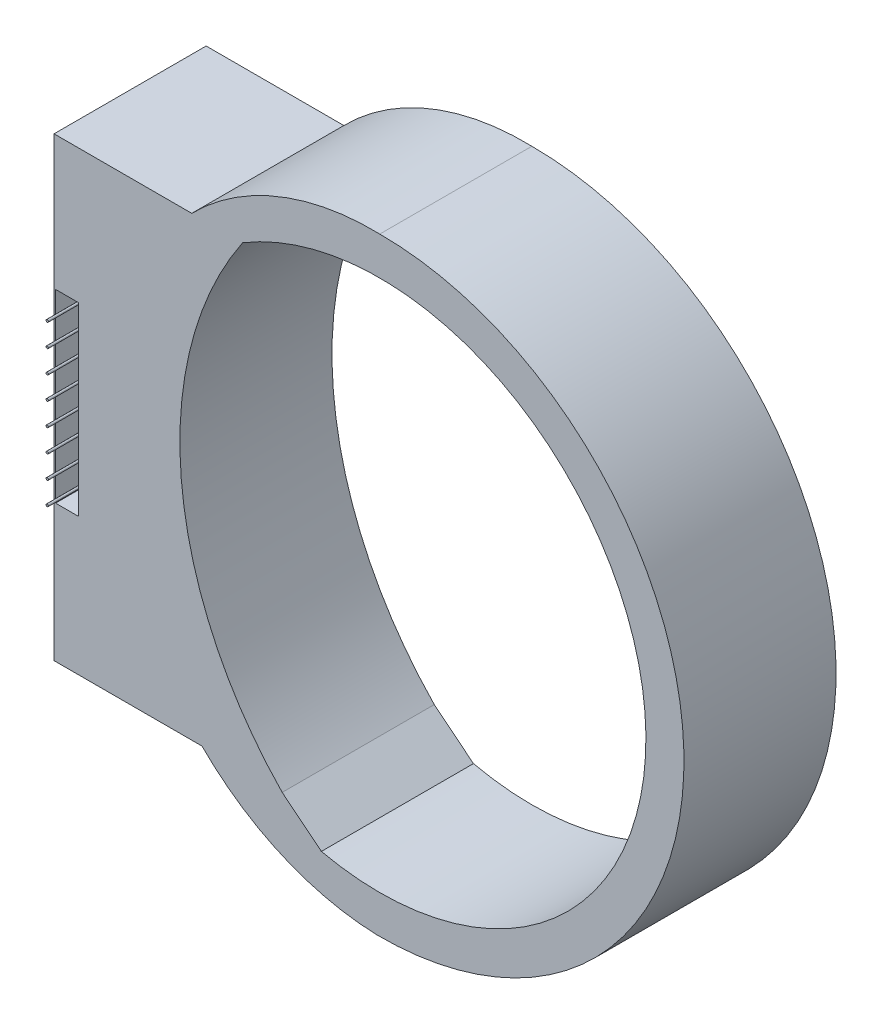
ISO-10303-21;
HEADER;
FILE_DESCRIPTION(('STEP AP214'),'2;1');
FILE_NAME('part.step','',(''),(''),'','','');
FILE_SCHEMA(('AUTOMOTIVE_DESIGN { 1 0 10303 214 1 1 1 1 }'));
ENDSEC;
DATA;
#1=APPLICATION_CONTEXT('core data for automotive mechanical design processes');
#2=APPLICATION_PROTOCOL_DEFINITION('international standard','automotive_design',2000,#1);
#3=PRODUCT_CONTEXT('',#1,'mechanical');
#4=PRODUCT('Part','Part','',(#3));
#5=PRODUCT_RELATED_PRODUCT_CATEGORY('part','',(#4));
#6=PRODUCT_DEFINITION_FORMATION('','',#4);
#7=PRODUCT_DEFINITION_CONTEXT('part definition',#1,'design');
#8=PRODUCT_DEFINITION('design','',#6,#7);
#9=PRODUCT_DEFINITION_SHAPE('','',#8);
#10=(LENGTH_UNIT() NAMED_UNIT(*) SI_UNIT(.MILLI.,.METRE.));
#11=(NAMED_UNIT(*) PLANE_ANGLE_UNIT() SI_UNIT($,.RADIAN.));
#12=(NAMED_UNIT(*) SI_UNIT($,.STERADIAN.) SOLID_ANGLE_UNIT());
#13=UNCERTAINTY_MEASURE_WITH_UNIT(LENGTH_MEASURE(1.E-05),#10,'distance_accuracy_value','');
#14=(GEOMETRIC_REPRESENTATION_CONTEXT(3) GLOBAL_UNCERTAINTY_ASSIGNED_CONTEXT((#13)) GLOBAL_UNIT_ASSIGNED_CONTEXT((#10,
#11,#12)) REPRESENTATION_CONTEXT('',''));
#15=CARTESIAN_POINT('',(0.,0.,0.));
#16=DIRECTION('',(0.,0.,1.));
#17=DIRECTION('',(1.,0.,0.));
#18=AXIS2_PLACEMENT_3D('',#15,#16,#17);
#19=CARTESIAN_POINT('',(-25.0193855044636,-31.0780217274881,25.4));
#20=DIRECTION('',(0.627091051685039,0.778945962757721,0.));
#21=DIRECTION('',(-0.778945962757721,0.627091051685039,0.));
#22=AXIS2_PLACEMENT_3D('',#19,#20,#21);
#23=PLANE('',#22);
#24=DIRECTION('',(0.778945962757721,-0.627091051685039,0.));
#25=VECTOR('',#24,1.);
#26=CARTESIAN_POINT('',(-25.0193855044636,-31.0780217274881,0.));
#27=LINE('',#26,#25);
#28=CARTESIAN_POINT('',(-16.2969812997664,-38.1,0.));
#29=VERTEX_POINT('',#28);
#30=CARTESIAN_POINT('',(-9.75543472759003,-43.3662771433718,0.));
#31=VERTEX_POINT('',#30);
#32=EDGE_CURVE('E142',#29,#31,#27,.T.);
#33=ORIENTED_EDGE('',*,*,#32,.F.);
#34=DIRECTION('',(0.,0.,-1.));
#35=VECTOR('',#34,1.);
#36=CARTESIAN_POINT('',(-16.2969812997664,-38.1,25.4));
#37=LINE('',#36,#35);
#38=CARTESIAN_POINT('',(-16.2969812997664,-38.1,25.4));
#39=VERTEX_POINT('',#38);
#40=EDGE_CURVE('E11',#39,#29,#37,.T.);
#41=ORIENTED_EDGE('',*,*,#40,.F.);
#42=DIRECTION('',(0.778945962757721,-0.627091051685039,0.));
#43=VECTOR('',#42,1.);
#44=CARTESIAN_POINT('',(-25.0193855044636,-31.0780217274881,25.4));
#45=LINE('',#44,#43);
#46=CARTESIAN_POINT('',(-9.75543472759003,-43.3662771433718,25.4));
#47=VERTEX_POINT('',#46);
#48=EDGE_CURVE('E140',#39,#47,#45,.T.);
#49=ORIENTED_EDGE('',*,*,#48,.T.);
#50=DIRECTION('',(0.,0.,-1.));
#51=VECTOR('',#50,1.);
#52=CARTESIAN_POINT('',(-9.75543472759003,-43.3662771433718,25.4));
#53=LINE('',#52,#51);
#54=EDGE_CURVE('E77',#47,#31,#53,.T.);
#55=ORIENTED_EDGE('',*,*,#54,.T.);
#56=EDGE_LOOP('',(#33,#41,#49,#55));
#57=FACE_BOUND('',#56,.T.);
#58=ADVANCED_FACE('F51',(#57),#23,.T.);
#59=CARTESIAN_POINT('',(27.1543478177107,4.04819094237765,25.4));
#60=DIRECTION('',(0.,0.,-1.));
#61=DIRECTION('',(-1.,0.,0.));
#62=AXIS2_PLACEMENT_3D('',#59,#60,#61);
#63=CYLINDRICAL_SURFACE('',#62,60.5350146757266);
#64=CARTESIAN_POINT('',(27.1543478177107,4.04819094237765,0.));
#65=DIRECTION('',(0.,0.,1.));
#66=DIRECTION('',(1.,0.,0.));
#67=AXIS2_PLACEMENT_3D('',#64,#65,#66);
#68=CIRCLE('',#67,60.5350146757266);
#69=CARTESIAN_POINT('',(-22.8952505991963,38.1,0.));
#70=VERTEX_POINT('',#69);
#71=EDGE_CURVE('E179',#29,#70,#68,.F.);
#72=ORIENTED_EDGE('',*,*,#71,.T.);
#73=DIRECTION('',(0.,0.,-1.));
#74=VECTOR('',#73,1.);
#75=CARTESIAN_POINT('',(-22.8952505991963,38.1,25.4));
#76=LINE('',#75,#74);
#77=CARTESIAN_POINT('',(-22.8952505991963,38.1,25.4));
#78=VERTEX_POINT('',#77);
#79=EDGE_CURVE('E60',#78,#70,#76,.T.);
#80=ORIENTED_EDGE('',*,*,#79,.F.);
#81=CARTESIAN_POINT('',(27.1543478177107,4.04819094237765,25.4));
#82=DIRECTION('',(0.,0.,1.));
#83=DIRECTION('',(1.,0.,0.));
#84=AXIS2_PLACEMENT_3D('',#81,#82,#83);
#85=CIRCLE('',#84,60.5350146757266);
#86=EDGE_CURVE('E147',#39,#78,#85,.F.);
#87=ORIENTED_EDGE('',*,*,#86,.F.);
#88=ORIENTED_EDGE('',*,*,#40,.T.);
#89=EDGE_LOOP('',(#72,#80,#87,#88));
#90=FACE_BOUND('',#89,.T.);
#91=ADVANCED_FACE('F148',(#90),#63,.F.);
#92=CARTESIAN_POINT('',(0.,0.,25.4));
#93=DIRECTION('',(0.,0.,-1.));
#94=DIRECTION('',(-1.,0.,0.));
#95=AXIS2_PLACEMENT_3D('',#92,#93,#94);
#96=CYLINDRICAL_SURFACE('',#95,50.8);
#97=CARTESIAN_POINT('',(0.,0.,0.));
#98=DIRECTION('',(0.,0.,1.));
#99=DIRECTION('',(1.,0.,0.));
#100=AXIS2_PLACEMENT_3D('',#97,#98,#99);
#101=CIRCLE('',#100,50.8);
#102=CARTESIAN_POINT('',(-0.524948031046554,-50.7972876201545,0.));
#103=VERTEX_POINT('',#102);
#104=CARTESIAN_POINT('',(0.,50.8,0.));
#105=VERTEX_POINT('',#104);
#106=EDGE_CURVE('E162',#103,#105,#101,.T.);
#107=ORIENTED_EDGE('',*,*,#106,.T.);
#108=DIRECTION('',(0.,0.,-1.));
#109=VECTOR('',#108,1.);
#110=CARTESIAN_POINT('',(0.,50.8,25.4));
#111=LINE('',#110,#109);
#112=CARTESIAN_POINT('',(0.,50.8,25.4));
#113=VERTEX_POINT('',#112);
#114=EDGE_CURVE('E55',#113,#105,#111,.T.);
#115=ORIENTED_EDGE('',*,*,#114,.F.);
#116=CARTESIAN_POINT('',(0.,0.,25.4));
#117=DIRECTION('',(0.,0.,1.));
#118=DIRECTION('',(1.,0.,0.));
#119=AXIS2_PLACEMENT_3D('',#116,#117,#118);
#120=CIRCLE('',#119,50.8);
#121=CARTESIAN_POINT('',(-0.524948031046554,-50.7972876201545,25.4));
#122=VERTEX_POINT('',#121);
#123=EDGE_CURVE('E184',#122,#113,#120,.T.);
#124=ORIENTED_EDGE('',*,*,#123,.F.);
#125=DIRECTION('',(0.,0.,-1.));
#126=VECTOR('',#125,1.);
#127=CARTESIAN_POINT('',(-0.524948031046554,-50.7972876201545,25.4));
#128=LINE('',#127,#126);
#129=EDGE_CURVE('E161',#122,#103,#128,.T.);
#130=ORIENTED_EDGE('',*,*,#129,.T.);
#131=EDGE_LOOP('',(#107,#115,#124,#130));
#132=FACE_BOUND('',#131,.T.);
#133=ADVANCED_FACE('F53',(#132),#96,.T.);
#134=CARTESIAN_POINT('',(-1.12823797841324,8.43151465463102,25.4));
#135=DIRECTION('',(0.,0.,-1.));
#136=DIRECTION('',(-1.,0.,0.));
#137=AXIS2_PLACEMENT_3D('',#134,#135,#136);
#138=CYLINDRICAL_SURFACE('',#137,42.3835047087506);
#139=CARTESIAN_POINT('',(-1.12823797841324,8.43151465463102,0.));
#140=DIRECTION('',(0.,0.,1.));
#141=DIRECTION('',(1.,0.,0.));
#142=AXIS2_PLACEMENT_3D('',#139,#140,#141);
#143=CIRCLE('',#142,42.3835047087506);
#144=CARTESIAN_POINT('',(-31.3960831066728,38.1,0.));
#145=VERTEX_POINT('',#144);
#146=EDGE_CURVE('E165',#105,#145,#143,.T.);
#147=ORIENTED_EDGE('',*,*,#146,.T.);
#148=DIRECTION('',(0.,0.,-1.));
#149=VECTOR('',#148,1.);
#150=CARTESIAN_POINT('',(-31.3960831066728,38.1,25.4));
#151=LINE('',#150,#149);
#152=CARTESIAN_POINT('',(-31.3960831066728,38.1,25.4));
#153=VERTEX_POINT('',#152);
#154=EDGE_CURVE('E195',#153,#145,#151,.T.);
#155=ORIENTED_EDGE('',*,*,#154,.F.);
#156=CARTESIAN_POINT('',(-1.12823797841324,8.43151465463102,25.4));
#157=DIRECTION('',(0.,0.,1.));
#158=DIRECTION('',(1.,0.,0.));
#159=AXIS2_PLACEMENT_3D('',#156,#157,#158);
#160=CIRCLE('',#159,42.3835047087506);
#161=EDGE_CURVE('E119',#113,#153,#160,.T.);
#162=ORIENTED_EDGE('',*,*,#161,.F.);
#163=ORIENTED_EDGE('',*,*,#114,.T.);
#164=EDGE_LOOP('',(#147,#155,#162,#163));
#165=FACE_BOUND('',#164,.T.);
#166=ADVANCED_FACE('F201',(#165),#138,.T.);
#167=CARTESIAN_POINT('',(0.,38.1,25.4));
#168=DIRECTION('',(0.,-1.,0.));
#169=DIRECTION('',(0.,0.,-1.));
#170=AXIS2_PLACEMENT_3D('',#167,#168,#169);
#171=PLANE('',#170);
#172=DIRECTION('',(-1.,0.,0.));
#173=VECTOR('',#172,1.);
#174=CARTESIAN_POINT('',(0.,38.1,0.));
#175=LINE('',#174,#173);
#176=CARTESIAN_POINT('',(-54.3969812997664,38.1,0.));
#177=VERTEX_POINT('',#176);
#178=EDGE_CURVE('E168',#145,#177,#175,.T.);
#179=ORIENTED_EDGE('',*,*,#178,.T.);
#180=DIRECTION('',(0.,0.,-1.));
#181=VECTOR('',#180,1.);
#182=CARTESIAN_POINT('',(-54.3969812997664,38.1,25.4));
#183=LINE('',#182,#181);
#184=CARTESIAN_POINT('',(-54.3969812997664,38.1,25.4));
#185=VERTEX_POINT('',#184);
#186=EDGE_CURVE('E193',#185,#177,#183,.T.);
#187=ORIENTED_EDGE('',*,*,#186,.F.);
#188=DIRECTION('',(-1.,0.,0.));
#189=VECTOR('',#188,1.);
#190=CARTESIAN_POINT('',(0.,38.1,25.4));
#191=LINE('',#190,#189);
#192=EDGE_CURVE('E225',#153,#185,#191,.T.);
#193=ORIENTED_EDGE('',*,*,#192,.F.);
#194=ORIENTED_EDGE('',*,*,#154,.T.);
#195=EDGE_LOOP('',(#179,#187,#193,#194));
#196=FACE_BOUND('',#195,.T.);
#197=ADVANCED_FACE('F224',(#196),#171,.F.);
#198=CARTESIAN_POINT('',(-54.3969812997664,0.,25.4));
#199=DIRECTION('',(1.,0.,0.));
#200=DIRECTION('',(0.,1.,0.));
#201=AXIS2_PLACEMENT_3D('',#198,#199,#200);
#202=PLANE('',#201);
#203=DIRECTION('',(0.,-1.,0.));
#204=VECTOR('',#203,1.);
#205=CARTESIAN_POINT('',(-54.3969812997664,0.,0.));
#206=LINE('',#205,#204);
#207=CARTESIAN_POINT('',(-54.3969812997664,-38.1,0.));
#208=VERTEX_POINT('',#207);
#209=EDGE_CURVE('E170',#177,#208,#206,.T.);
#210=ORIENTED_EDGE('',*,*,#209,.T.);
#211=DIRECTION('',(0.,0.,-1.));
#212=VECTOR('',#211,1.);
#213=CARTESIAN_POINT('',(-54.3969812997664,-38.1,25.4));
#214=LINE('',#213,#212);
#215=CARTESIAN_POINT('',(-54.3969812997664,-38.1,25.4));
#216=VERTEX_POINT('',#215);
#217=EDGE_CURVE('E190',#216,#208,#214,.T.);
#218=ORIENTED_EDGE('',*,*,#217,.F.);
#219=DIRECTION('',(0.,-1.,0.));
#220=VECTOR('',#219,1.);
#221=CARTESIAN_POINT('',(-54.3969812997664,0.,25.4));
#222=LINE('',#221,#220);
#223=EDGE_CURVE('E223',#185,#216,#222,.T.);
#224=ORIENTED_EDGE('',*,*,#223,.F.);
#225=ORIENTED_EDGE('',*,*,#186,.T.);
#226=EDGE_LOOP('',(#210,#218,#224,#225));
#227=FACE_BOUND('',#226,.T.);
#228=ADVANCED_FACE('F220',(#227),#202,.F.);
#229=CARTESIAN_POINT('',(0.,-38.1,25.4));
#230=DIRECTION('',(0.,1.,0.));
#231=DIRECTION('',(-1.,0.,0.));
#232=AXIS2_PLACEMENT_3D('',#229,#230,#231);
#233=PLANE('',#232);
#234=DIRECTION('',(1.,0.,0.));
#235=VECTOR('',#234,1.);
#236=CARTESIAN_POINT('',(0.,-38.1,0.));
#237=LINE('',#236,#235);
#238=CARTESIAN_POINT('',(-29.6869274729817,-38.1,0.));
#239=VERTEX_POINT('',#238);
#240=EDGE_CURVE('E172',#208,#239,#237,.T.);
#241=ORIENTED_EDGE('',*,*,#240,.T.);
#242=DIRECTION('',(0.,0.,-1.));
#243=VECTOR('',#242,1.);
#244=CARTESIAN_POINT('',(-29.6869274729817,-38.1,25.4));
#245=LINE('',#244,#243);
#246=CARTESIAN_POINT('',(-29.6869274729817,-38.1,25.4));
#247=VERTEX_POINT('',#246);
#248=EDGE_CURVE('E188',#247,#239,#245,.T.);
#249=ORIENTED_EDGE('',*,*,#248,.F.);
#250=DIRECTION('',(1.,0.,0.));
#251=VECTOR('',#250,1.);
#252=CARTESIAN_POINT('',(0.,-38.1,25.4));
#253=LINE('',#252,#251);
#254=EDGE_CURVE('E156',#216,#247,#253,.T.);
#255=ORIENTED_EDGE('',*,*,#254,.F.);
#256=ORIENTED_EDGE('',*,*,#217,.T.);
#257=EDGE_LOOP('',(#241,#249,#255,#256));
#258=FACE_BOUND('',#257,.T.);
#259=ADVANCED_FACE('F216',(#258),#233,.F.);
#260=CARTESIAN_POINT('',(0.941640843274937,-7.59201969566155,25.4));
#261=DIRECTION('',(0.,0.,-1.));
#262=DIRECTION('',(-1.,0.,0.));
#263=AXIS2_PLACEMENT_3D('',#260,#261,#262);
#264=CYLINDRICAL_SURFACE('',#263,43.2301522013687);
#265=CARTESIAN_POINT('',(0.941640843274937,-7.59201969566155,0.));
#266=DIRECTION('',(0.,0.,1.));
#267=DIRECTION('',(1.,0.,0.));
#268=AXIS2_PLACEMENT_3D('',#265,#266,#267);
#269=CIRCLE('',#268,43.2301522013687);
#270=EDGE_CURVE('E175',#103,#239,#269,.F.);
#271=ORIENTED_EDGE('',*,*,#270,.F.);
#272=ORIENTED_EDGE('',*,*,#129,.F.);
#273=CARTESIAN_POINT('',(0.941640843274937,-7.59201969566155,25.4));
#274=DIRECTION('',(0.,0.,1.));
#275=DIRECTION('',(1.,0.,0.));
#276=AXIS2_PLACEMENT_3D('',#273,#274,#275);
#277=CIRCLE('',#276,43.2301522013687);
#278=EDGE_CURVE('E153',#122,#247,#277,.F.);
#279=ORIENTED_EDGE('',*,*,#278,.T.);
#280=ORIENTED_EDGE('',*,*,#248,.T.);
#281=EDGE_LOOP('',(#271,#272,#279,#280));
#282=FACE_BOUND('',#281,.T.);
#283=ADVANCED_FACE('F211',(#282),#264,.T.);
#284=CARTESIAN_POINT('',(0.,0.,25.4));
#285=DIRECTION('',(0.,0.,-1.));
#286=DIRECTION('',(-1.,0.,0.));
#287=AXIS2_PLACEMENT_3D('',#284,#285,#286);
#288=CYLINDRICAL_SURFACE('',#287,44.45);
#289=CARTESIAN_POINT('',(0.,0.,0.));
#290=DIRECTION('',(0.,0.,1.));
#291=DIRECTION('',(1.,0.,0.));
#292=AXIS2_PLACEMENT_3D('',#289,#290,#291);
#293=CIRCLE('',#292,44.45);
#294=EDGE_CURVE('E181',#31,#70,#293,.T.);
#295=ORIENTED_EDGE('',*,*,#294,.F.);
#296=ORIENTED_EDGE('',*,*,#54,.F.);
#297=CARTESIAN_POINT('',(0.,0.,25.4));
#298=DIRECTION('',(0.,0.,1.));
#299=DIRECTION('',(1.,0.,0.));
#300=AXIS2_PLACEMENT_3D('',#297,#298,#299);
#301=CIRCLE('',#300,44.45);
#302=EDGE_CURVE('E150',#47,#78,#301,.T.);
#303=ORIENTED_EDGE('',*,*,#302,.T.);
#304=ORIENTED_EDGE('',*,*,#79,.T.);
#305=EDGE_LOOP('',(#295,#296,#303,#304));
#306=FACE_BOUND('',#305,.T.);
#307=ADVANCED_FACE('F385',(#306),#288,.F.);
#308=CARTESIAN_POINT('',(0.,0.,25.4));
#309=DIRECTION('',(0.,0.,1.));
#310=DIRECTION('',(1.,0.,0.));
#311=AXIS2_PLACEMENT_3D('',#308,#309,#310);
#312=PLANE('',#311);
#313=DIRECTION('',(0.,-1.,0.));
#314=VECTOR('',#313,1.);
#315=CARTESIAN_POINT('',(-54.1429812997664,15.7257596428129,25.4));
#316=LINE('',#315,#314);
#317=CARTESIAN_POINT('',(-54.1429812997664,15.7257596428129,25.4));
#318=VERTEX_POINT('',#317);
#319=CARTESIAN_POINT('',(-54.1429812997664,-15.1881268345115,25.4));
#320=VERTEX_POINT('',#319);
#321=EDGE_CURVE('E68',#318,#320,#316,.T.);
#322=ORIENTED_EDGE('',*,*,#321,.F.);
#323=DIRECTION('',(-1.,0.,0.));
#324=VECTOR('',#323,1.);
#325=CARTESIAN_POINT('',(-54.1429812997664,15.7257596428129,25.4));
#326=LINE('',#325,#324);
#327=CARTESIAN_POINT('',(-50.3329812997664,15.7257596428129,25.4));
#328=VERTEX_POINT('',#327);
#329=EDGE_CURVE('E242',#328,#318,#326,.T.);
#330=ORIENTED_EDGE('',*,*,#329,.F.);
#331=DIRECTION('',(0.,1.,0.));
#332=VECTOR('',#331,1.);
#333=CARTESIAN_POINT('',(-50.3329812997664,15.7257596428129,25.4));
#334=LINE('',#333,#332);
#335=CARTESIAN_POINT('',(-50.3329812997664,-15.1881268345115,25.4));
#336=VERTEX_POINT('',#335);
#337=EDGE_CURVE('E246',#336,#328,#334,.T.);
#338=ORIENTED_EDGE('',*,*,#337,.F.);
#339=DIRECTION('',(1.,0.,0.));
#340=VECTOR('',#339,1.);
#341=CARTESIAN_POINT('',(-54.1429812997664,-15.1881268345115,25.4));
#342=LINE('',#341,#340);
#343=EDGE_CURVE('E249',#320,#336,#342,.T.);
#344=ORIENTED_EDGE('',*,*,#343,.F.);
#345=EDGE_LOOP('',(#322,#330,#338,#344));
#346=FACE_BOUND('',#345,.T.);
#347=ORIENTED_EDGE('',*,*,#123,.T.);
#348=ORIENTED_EDGE('',*,*,#161,.T.);
#349=ORIENTED_EDGE('',*,*,#192,.T.);
#350=ORIENTED_EDGE('',*,*,#223,.T.);
#351=ORIENTED_EDGE('',*,*,#254,.T.);
#352=ORIENTED_EDGE('',*,*,#278,.F.);
#353=EDGE_LOOP('',(#347,#348,#349,#350,#351,#352));
#354=FACE_BOUND('',#353,.T.);
#355=ORIENTED_EDGE('',*,*,#48,.F.);
#356=ORIENTED_EDGE('',*,*,#86,.T.);
#357=ORIENTED_EDGE('',*,*,#302,.F.);
#358=EDGE_LOOP('',(#355,#356,#357));
#359=FACE_BOUND('',#358,.T.);
#360=ADVANCED_FACE('F152',(#346,#354,#359),#312,.T.);
#361=CARTESIAN_POINT('',(0.,0.,0.));
#362=DIRECTION('',(0.,0.,1.));
#363=DIRECTION('',(1.,0.,0.));
#364=AXIS2_PLACEMENT_3D('',#361,#362,#363);
#365=PLANE('',#364);
#366=ORIENTED_EDGE('',*,*,#106,.F.);
#367=ORIENTED_EDGE('',*,*,#270,.T.);
#368=ORIENTED_EDGE('',*,*,#240,.F.);
#369=ORIENTED_EDGE('',*,*,#209,.F.);
#370=ORIENTED_EDGE('',*,*,#178,.F.);
#371=ORIENTED_EDGE('',*,*,#146,.F.);
#372=EDGE_LOOP('',(#366,#367,#368,#369,#370,#371));
#373=FACE_BOUND('',#372,.T.);
#374=ORIENTED_EDGE('',*,*,#32,.T.);
#375=ORIENTED_EDGE('',*,*,#294,.T.);
#376=ORIENTED_EDGE('',*,*,#71,.F.);
#377=EDGE_LOOP('',(#374,#375,#376));
#378=FACE_BOUND('',#377,.T.);
#379=ADVANCED_FACE('F207',(#373,#378),#365,.F.);
#380=CARTESIAN_POINT('',(-54.1429812997664,15.7257596428129,0.761999999999999));
#381=DIRECTION('',(-1.,0.,0.));
#382=DIRECTION('',(0.,-1.,0.));
#383=AXIS2_PLACEMENT_3D('',#380,#381,#382);
#384=PLANE('',#383);
#385=ORIENTED_EDGE('',*,*,#321,.T.);
#386=DIRECTION('',(0.,0.,1.));
#387=VECTOR('',#386,1.);
#388=CARTESIAN_POINT('',(-54.1429812997664,-15.1881268345115,0.761999999999999));
#389=LINE('',#388,#387);
#390=CARTESIAN_POINT('',(-54.1429812997664,-15.1881268345115,0.761999999999999));
#391=VERTEX_POINT('',#390);
#392=EDGE_CURVE('E232',#391,#320,#389,.T.);
#393=ORIENTED_EDGE('',*,*,#392,.F.);
#394=DIRECTION('',(0.,-1.,0.));
#395=VECTOR('',#394,1.);
#396=CARTESIAN_POINT('',(-54.1429812997664,15.7257596428129,0.761999999999999));
#397=LINE('',#396,#395);
#398=CARTESIAN_POINT('',(-54.1429812997664,15.7257596428129,0.761999999999999));
#399=VERTEX_POINT('',#398);
#400=EDGE_CURVE('E245',#399,#391,#397,.T.);
#401=ORIENTED_EDGE('',*,*,#400,.F.);
#402=DIRECTION('',(0.,0.,1.));
#403=VECTOR('',#402,1.);
#404=CARTESIAN_POINT('',(-54.1429812997664,15.7257596428129,0.761999999999999));
#405=LINE('',#404,#403);
#406=EDGE_CURVE('E166',#399,#318,#405,.T.);
#407=ORIENTED_EDGE('',*,*,#406,.T.);
#408=EDGE_LOOP('',(#385,#393,#401,#407));
#409=FACE_BOUND('',#408,.T.);
#410=ADVANCED_FACE('F347',(#409),#384,.F.);
#411=CARTESIAN_POINT('',(-54.1429812997664,15.7257596428129,0.761999999999999));
#412=DIRECTION('',(0.,1.,0.));
#413=DIRECTION('',(0.,0.,1.));
#414=AXIS2_PLACEMENT_3D('',#411,#412,#413);
#415=PLANE('',#414);
#416=ORIENTED_EDGE('',*,*,#329,.T.);
#417=ORIENTED_EDGE('',*,*,#406,.F.);
#418=DIRECTION('',(-1.,0.,0.));
#419=VECTOR('',#418,1.);
#420=CARTESIAN_POINT('',(-54.1429812997664,15.7257596428129,0.761999999999999));
#421=LINE('',#420,#419);
#422=CARTESIAN_POINT('',(-50.3329812997664,15.7257596428129,0.761999999999999));
#423=VERTEX_POINT('',#422);
#424=EDGE_CURVE('E235',#423,#399,#421,.T.);
#425=ORIENTED_EDGE('',*,*,#424,.F.);
#426=DIRECTION('',(0.,0.,1.));
#427=VECTOR('',#426,1.);
#428=CARTESIAN_POINT('',(-50.3329812997664,15.7257596428129,0.761999999999999));
#429=LINE('',#428,#427);
#430=EDGE_CURVE('E238',#423,#328,#429,.T.);
#431=ORIENTED_EDGE('',*,*,#430,.T.);
#432=EDGE_LOOP('',(#416,#417,#425,#431));
#433=FACE_BOUND('',#432,.T.);
#434=ADVANCED_FACE('F358',(#433),#415,.F.);
#435=CARTESIAN_POINT('',(-50.3329812997664,15.7257596428129,0.761999999999999));
#436=DIRECTION('',(1.,0.,0.));
#437=DIRECTION('',(0.,1.,0.));
#438=AXIS2_PLACEMENT_3D('',#435,#436,#437);
#439=PLANE('',#438);
#440=ORIENTED_EDGE('',*,*,#337,.T.);
#441=ORIENTED_EDGE('',*,*,#430,.F.);
#442=DIRECTION('',(0.,1.,0.));
#443=VECTOR('',#442,1.);
#444=CARTESIAN_POINT('',(-50.3329812997664,15.7257596428129,0.761999999999999));
#445=LINE('',#444,#443);
#446=CARTESIAN_POINT('',(-50.3329812997664,-15.1881268345115,0.761999999999999));
#447=VERTEX_POINT('',#446);
#448=EDGE_CURVE('E256',#447,#423,#445,.T.);
#449=ORIENTED_EDGE('',*,*,#448,.F.);
#450=DIRECTION('',(0.,0.,1.));
#451=VECTOR('',#450,1.);
#452=CARTESIAN_POINT('',(-50.3329812997664,-15.1881268345115,0.761999999999999));
#453=LINE('',#452,#451);
#454=EDGE_CURVE('E234',#447,#336,#453,.T.);
#455=ORIENTED_EDGE('',*,*,#454,.T.);
#456=EDGE_LOOP('',(#440,#441,#449,#455));
#457=FACE_BOUND('',#456,.T.);
#458=ADVANCED_FACE('F363',(#457),#439,.F.);
#459=CARTESIAN_POINT('',(-54.1429812997664,-15.1881268345115,0.761999999999999));
#460=DIRECTION('',(0.,-1.,0.));
#461=DIRECTION('',(0.,0.,-1.));
#462=AXIS2_PLACEMENT_3D('',#459,#460,#461);
#463=PLANE('',#462);
#464=ORIENTED_EDGE('',*,*,#343,.T.);
#465=ORIENTED_EDGE('',*,*,#454,.F.);
#466=DIRECTION('',(1.,0.,0.));
#467=VECTOR('',#466,1.);
#468=CARTESIAN_POINT('',(-54.1429812997664,-15.1881268345115,0.761999999999999));
#469=LINE('',#468,#467);
#470=EDGE_CURVE('E259',#391,#447,#469,.T.);
#471=ORIENTED_EDGE('',*,*,#470,.F.);
#472=ORIENTED_EDGE('',*,*,#392,.T.);
#473=EDGE_LOOP('',(#464,#465,#471,#472));
#474=FACE_BOUND('',#473,.T.);
#475=ADVANCED_FACE('F325',(#474),#463,.F.);
#476=CARTESIAN_POINT('',(0.,0.,0.761999999999999));
#477=DIRECTION('',(0.,0.,1.));
#478=DIRECTION('',(1.,0.,0.));
#479=AXIS2_PLACEMENT_3D('',#476,#477,#478);
#480=PLANE('',#479);
#481=CARTESIAN_POINT('',(-52.2379812997664,-12.9050109148153,0.761999999999999));
#482=DIRECTION('',(0.,0.,1.));
#483=DIRECTION('',(1.,0.,0.));
#484=AXIS2_PLACEMENT_3D('',#481,#482,#483);
#485=CIRCLE('',#484,0.190500000000001);
#486=CARTESIAN_POINT('',(-52.0474812997664,-12.9050109148153,0.761999999999999));
#487=VERTEX_POINT('',#486);
#488=EDGE_CURVE('E306',#487,#487,#485,.T.);
#489=ORIENTED_EDGE('',*,*,#488,.F.);
#490=EDGE_LOOP('',(#489));
#491=FACE_BOUND('',#490,.T.);
#492=CARTESIAN_POINT('',(-52.2379812997664,-9.09501091481528,0.761999999999999));
#493=DIRECTION('',(0.,0.,1.));
#494=DIRECTION('',(1.,0.,0.));
#495=AXIS2_PLACEMENT_3D('',#492,#493,#494);
#496=CIRCLE('',#495,0.190500000000001);
#497=CARTESIAN_POINT('',(-52.0474812997664,-9.09501091481528,0.761999999999999));
#498=VERTEX_POINT('',#497);
#499=EDGE_CURVE('E303',#498,#498,#496,.T.);
#500=ORIENTED_EDGE('',*,*,#499,.F.);
#501=EDGE_LOOP('',(#500));
#502=FACE_BOUND('',#501,.T.);
#503=CARTESIAN_POINT('',(-52.2379812997664,-5.28501091481528,0.761999999999999));
#504=DIRECTION('',(0.,0.,1.));
#505=DIRECTION('',(1.,0.,0.));
#506=AXIS2_PLACEMENT_3D('',#503,#504,#505);
#507=CIRCLE('',#506,0.190500000000001);
#508=CARTESIAN_POINT('',(-52.0474812997664,-5.28501091481528,0.761999999999999));
#509=VERTEX_POINT('',#508);
#510=EDGE_CURVE('E297',#509,#509,#507,.T.);
#511=ORIENTED_EDGE('',*,*,#510,.F.);
#512=EDGE_LOOP('',(#511));
#513=FACE_BOUND('',#512,.T.);
#514=CARTESIAN_POINT('',(-52.2379812997664,-1.47501091481528,0.761999999999999));
#515=DIRECTION('',(0.,0.,1.));
#516=DIRECTION('',(1.,0.,0.));
#517=AXIS2_PLACEMENT_3D('',#514,#515,#516);
#518=CIRCLE('',#517,0.190500000000001);
#519=CARTESIAN_POINT('',(-52.0474812997664,-1.47501091481528,0.761999999999999));
#520=VERTEX_POINT('',#519);
#521=EDGE_CURVE('E291',#520,#520,#518,.T.);
#522=ORIENTED_EDGE('',*,*,#521,.F.);
#523=EDGE_LOOP('',(#522));
#524=FACE_BOUND('',#523,.T.);
#525=CARTESIAN_POINT('',(-52.2379812997664,2.33498908518472,0.761999999999999));
#526=DIRECTION('',(0.,0.,1.));
#527=DIRECTION('',(1.,0.,0.));
#528=AXIS2_PLACEMENT_3D('',#525,#526,#527);
#529=CIRCLE('',#528,0.190500000000001);
#530=CARTESIAN_POINT('',(-52.0474812997664,2.33498908518472,0.761999999999999));
#531=VERTEX_POINT('',#530);
#532=EDGE_CURVE('E285',#531,#531,#529,.T.);
#533=ORIENTED_EDGE('',*,*,#532,.F.);
#534=EDGE_LOOP('',(#533));
#535=FACE_BOUND('',#534,.T.);
#536=CARTESIAN_POINT('',(-52.2379812997664,6.14498908518472,0.761999999999999));
#537=DIRECTION('',(0.,0.,1.));
#538=DIRECTION('',(1.,0.,0.));
#539=AXIS2_PLACEMENT_3D('',#536,#537,#538);
#540=CIRCLE('',#539,0.190500000000001);
#541=CARTESIAN_POINT('',(-52.0474812997664,6.14498908518472,0.761999999999999));
#542=VERTEX_POINT('',#541);
#543=EDGE_CURVE('E279',#542,#542,#540,.T.);
#544=ORIENTED_EDGE('',*,*,#543,.F.);
#545=EDGE_LOOP('',(#544));
#546=FACE_BOUND('',#545,.T.);
#547=CARTESIAN_POINT('',(-52.2379812997664,9.95498908518472,0.761999999999999));
#548=DIRECTION('',(0.,0.,1.));
#549=DIRECTION('',(1.,0.,0.));
#550=AXIS2_PLACEMENT_3D('',#547,#548,#549);
#551=CIRCLE('',#550,0.190500000000001);
#552=CARTESIAN_POINT('',(-52.0474812997664,9.95498908518472,0.761999999999999));
#553=VERTEX_POINT('',#552);
#554=EDGE_CURVE('E273',#553,#553,#551,.T.);
#555=ORIENTED_EDGE('',*,*,#554,.F.);
#556=EDGE_LOOP('',(#555));
#557=FACE_BOUND('',#556,.T.);
#558=CARTESIAN_POINT('',(-52.2379812997664,13.7649890851847,0.761999999999999));
#559=DIRECTION('',(0.,0.,1.));
#560=DIRECTION('',(1.,0.,0.));
#561=AXIS2_PLACEMENT_3D('',#558,#559,#560);
#562=CIRCLE('',#561,0.190500000000001);
#563=CARTESIAN_POINT('',(-52.0474812997664,13.7649890851847,0.761999999999999));
#564=VERTEX_POINT('',#563);
#565=EDGE_CURVE('E267',#564,#564,#562,.T.);
#566=ORIENTED_EDGE('',*,*,#565,.F.);
#567=EDGE_LOOP('',(#566));
#568=FACE_BOUND('',#567,.T.);
#569=ORIENTED_EDGE('',*,*,#400,.T.);
#570=ORIENTED_EDGE('',*,*,#470,.T.);
#571=ORIENTED_EDGE('',*,*,#448,.T.);
#572=ORIENTED_EDGE('',*,*,#424,.T.);
#573=EDGE_LOOP('',(#569,#570,#571,#572));
#574=FACE_BOUND('',#573,.T.);
#575=ADVANCED_FACE('F321',(#491,#502,#513,#524,#535,#546,#557,#568,#574),#480,.T.);
#576=CARTESIAN_POINT('',(-52.2379812997664,13.7649890851847,28.702));
#577=DIRECTION('',(0.,0.,-1.));
#578=DIRECTION('',(-1.,0.,0.));
#579=AXIS2_PLACEMENT_3D('',#576,#577,#578);
#580=CYLINDRICAL_SURFACE('',#579,0.190500000000001);
#581=CARTESIAN_POINT('',(-52.2379812997664,13.7649890851847,28.702));
#582=DIRECTION('',(0.,0.,1.));
#583=DIRECTION('',(1.,0.,0.));
#584=AXIS2_PLACEMENT_3D('',#581,#582,#583);
#585=CIRCLE('',#584,0.190500000000001);
#586=CARTESIAN_POINT('',(-52.0474812997664,13.7649890851847,28.702));
#587=VERTEX_POINT('',#586);
#588=EDGE_CURVE('E264',#587,#587,#585,.T.);
#589=ORIENTED_EDGE('',*,*,#588,.F.);
#590=EDGE_LOOP('',(#589));
#591=FACE_BOUND('',#590,.T.);
#592=ORIENTED_EDGE('',*,*,#565,.T.);
#593=EDGE_LOOP('',(#592));
#594=FACE_BOUND('',#593,.T.);
#595=ADVANCED_FACE('F324',(#591,#594),#580,.T.);
#596=CARTESIAN_POINT('',(-52.2379812997664,13.7649890851847,28.702));
#597=DIRECTION('',(0.,0.,1.));
#598=DIRECTION('',(1.,0.,0.));
#599=AXIS2_PLACEMENT_3D('',#596,#597,#598);
#600=PLANE('',#599);
#601=ORIENTED_EDGE('',*,*,#588,.T.);
#602=EDGE_LOOP('',(#601));
#603=FACE_BOUND('',#602,.T.);
#604=ADVANCED_FACE('F490',(#603),#600,.T.);
#605=CARTESIAN_POINT('',(-52.2379812997664,9.95498908518472,28.702));
#606=DIRECTION('',(0.,0.,-1.));
#607=DIRECTION('',(-1.,0.,0.));
#608=AXIS2_PLACEMENT_3D('',#605,#606,#607);
#609=CYLINDRICAL_SURFACE('',#608,0.190500000000001);
#610=CARTESIAN_POINT('',(-52.2379812997664,9.95498908518472,28.702));
#611=DIRECTION('',(0.,0.,1.));
#612=DIRECTION('',(1.,0.,0.));
#613=AXIS2_PLACEMENT_3D('',#610,#611,#612);
#614=CIRCLE('',#613,0.190500000000001);
#615=CARTESIAN_POINT('',(-52.0474812997664,9.95498908518472,28.702));
#616=VERTEX_POINT('',#615);
#617=EDGE_CURVE('E270',#616,#616,#614,.T.);
#618=ORIENTED_EDGE('',*,*,#617,.F.);
#619=EDGE_LOOP('',(#618));
#620=FACE_BOUND('',#619,.T.);
#621=ORIENTED_EDGE('',*,*,#554,.T.);
#622=EDGE_LOOP('',(#621));
#623=FACE_BOUND('',#622,.T.);
#624=ADVANCED_FACE('F499',(#620,#623),#609,.T.);
#625=CARTESIAN_POINT('',(-52.2379812997664,9.95498908518472,28.702));
#626=DIRECTION('',(0.,0.,1.));
#627=DIRECTION('',(1.,0.,0.));
#628=AXIS2_PLACEMENT_3D('',#625,#626,#627);
#629=PLANE('',#628);
#630=ORIENTED_EDGE('',*,*,#617,.T.);
#631=EDGE_LOOP('',(#630));
#632=FACE_BOUND('',#631,.T.);
#633=ADVANCED_FACE('F508',(#632),#629,.T.);
#634=CARTESIAN_POINT('',(-52.2379812997664,6.14498908518472,28.702));
#635=DIRECTION('',(0.,0.,-1.));
#636=DIRECTION('',(-1.,0.,0.));
#637=AXIS2_PLACEMENT_3D('',#634,#635,#636);
#638=CYLINDRICAL_SURFACE('',#637,0.190500000000001);
#639=CARTESIAN_POINT('',(-52.2379812997664,6.14498908518472,28.702));
#640=DIRECTION('',(0.,0.,1.));
#641=DIRECTION('',(1.,0.,0.));
#642=AXIS2_PLACEMENT_3D('',#639,#640,#641);
#643=CIRCLE('',#642,0.190500000000001);
#644=CARTESIAN_POINT('',(-52.0474812997664,6.14498908518472,28.702));
#645=VERTEX_POINT('',#644);
#646=EDGE_CURVE('E276',#645,#645,#643,.T.);
#647=ORIENTED_EDGE('',*,*,#646,.F.);
#648=EDGE_LOOP('',(#647));
#649=FACE_BOUND('',#648,.T.);
#650=ORIENTED_EDGE('',*,*,#543,.T.);
#651=EDGE_LOOP('',(#650));
#652=FACE_BOUND('',#651,.T.);
#653=ADVANCED_FACE('F517',(#649,#652),#638,.T.);
#654=CARTESIAN_POINT('',(-52.2379812997664,6.14498908518472,28.702));
#655=DIRECTION('',(0.,0.,1.));
#656=DIRECTION('',(1.,0.,0.));
#657=AXIS2_PLACEMENT_3D('',#654,#655,#656);
#658=PLANE('',#657);
#659=ORIENTED_EDGE('',*,*,#646,.T.);
#660=EDGE_LOOP('',(#659));
#661=FACE_BOUND('',#660,.T.);
#662=ADVANCED_FACE('F526',(#661),#658,.T.);
#663=CARTESIAN_POINT('',(-52.2379812997664,2.33498908518472,28.702));
#664=DIRECTION('',(0.,0.,-1.));
#665=DIRECTION('',(-1.,0.,0.));
#666=AXIS2_PLACEMENT_3D('',#663,#664,#665);
#667=CYLINDRICAL_SURFACE('',#666,0.190500000000001);
#668=CARTESIAN_POINT('',(-52.2379812997664,2.33498908518472,28.702));
#669=DIRECTION('',(0.,0.,1.));
#670=DIRECTION('',(1.,0.,0.));
#671=AXIS2_PLACEMENT_3D('',#668,#669,#670);
#672=CIRCLE('',#671,0.190500000000001);
#673=CARTESIAN_POINT('',(-52.0474812997664,2.33498908518472,28.702));
#674=VERTEX_POINT('',#673);
#675=EDGE_CURVE('E282',#674,#674,#672,.T.);
#676=ORIENTED_EDGE('',*,*,#675,.F.);
#677=EDGE_LOOP('',(#676));
#678=FACE_BOUND('',#677,.T.);
#679=ORIENTED_EDGE('',*,*,#532,.T.);
#680=EDGE_LOOP('',(#679));
#681=FACE_BOUND('',#680,.T.);
#682=ADVANCED_FACE('F535',(#678,#681),#667,.T.);
#683=CARTESIAN_POINT('',(-52.2379812997664,2.33498908518472,28.702));
#684=DIRECTION('',(0.,0.,1.));
#685=DIRECTION('',(1.,0.,0.));
#686=AXIS2_PLACEMENT_3D('',#683,#684,#685);
#687=PLANE('',#686);
#688=ORIENTED_EDGE('',*,*,#675,.T.);
#689=EDGE_LOOP('',(#688));
#690=FACE_BOUND('',#689,.T.);
#691=ADVANCED_FACE('F544',(#690),#687,.T.);
#692=CARTESIAN_POINT('',(-52.2379812997664,-1.47501091481528,28.702));
#693=DIRECTION('',(0.,0.,-1.));
#694=DIRECTION('',(-1.,0.,0.));
#695=AXIS2_PLACEMENT_3D('',#692,#693,#694);
#696=CYLINDRICAL_SURFACE('',#695,0.190500000000001);
#697=CARTESIAN_POINT('',(-52.2379812997664,-1.47501091481528,28.702));
#698=DIRECTION('',(0.,0.,1.));
#699=DIRECTION('',(1.,0.,0.));
#700=AXIS2_PLACEMENT_3D('',#697,#698,#699);
#701=CIRCLE('',#700,0.190500000000001);
#702=CARTESIAN_POINT('',(-52.0474812997664,-1.47501091481528,28.702));
#703=VERTEX_POINT('',#702);
#704=EDGE_CURVE('E288',#703,#703,#701,.T.);
#705=ORIENTED_EDGE('',*,*,#704,.F.);
#706=EDGE_LOOP('',(#705));
#707=FACE_BOUND('',#706,.T.);
#708=ORIENTED_EDGE('',*,*,#521,.T.);
#709=EDGE_LOOP('',(#708));
#710=FACE_BOUND('',#709,.T.);
#711=ADVANCED_FACE('F553',(#707,#710),#696,.T.);
#712=CARTESIAN_POINT('',(-52.2379812997664,-1.47501091481528,28.702));
#713=DIRECTION('',(0.,0.,1.));
#714=DIRECTION('',(1.,0.,0.));
#715=AXIS2_PLACEMENT_3D('',#712,#713,#714);
#716=PLANE('',#715);
#717=ORIENTED_EDGE('',*,*,#704,.T.);
#718=EDGE_LOOP('',(#717));
#719=FACE_BOUND('',#718,.T.);
#720=ADVANCED_FACE('F562',(#719),#716,.T.);
#721=CARTESIAN_POINT('',(-52.2379812997664,-5.28501091481528,28.702));
#722=DIRECTION('',(0.,0.,-1.));
#723=DIRECTION('',(-1.,0.,0.));
#724=AXIS2_PLACEMENT_3D('',#721,#722,#723);
#725=CYLINDRICAL_SURFACE('',#724,0.190500000000001);
#726=CARTESIAN_POINT('',(-52.2379812997664,-5.28501091481528,28.702));
#727=DIRECTION('',(0.,0.,1.));
#728=DIRECTION('',(1.,0.,0.));
#729=AXIS2_PLACEMENT_3D('',#726,#727,#728);
#730=CIRCLE('',#729,0.190500000000001);
#731=CARTESIAN_POINT('',(-52.0474812997664,-5.28501091481528,28.702));
#732=VERTEX_POINT('',#731);
#733=EDGE_CURVE('E294',#732,#732,#730,.T.);
#734=ORIENTED_EDGE('',*,*,#733,.F.);
#735=EDGE_LOOP('',(#734));
#736=FACE_BOUND('',#735,.T.);
#737=ORIENTED_EDGE('',*,*,#510,.T.);
#738=EDGE_LOOP('',(#737));
#739=FACE_BOUND('',#738,.T.);
#740=ADVANCED_FACE('F571',(#736,#739),#725,.T.);
#741=CARTESIAN_POINT('',(-52.2379812997664,-5.28501091481528,28.702));
#742=DIRECTION('',(0.,0.,1.));
#743=DIRECTION('',(1.,0.,0.));
#744=AXIS2_PLACEMENT_3D('',#741,#742,#743);
#745=PLANE('',#744);
#746=ORIENTED_EDGE('',*,*,#733,.T.);
#747=EDGE_LOOP('',(#746));
#748=FACE_BOUND('',#747,.T.);
#749=ADVANCED_FACE('F580',(#748),#745,.T.);
#750=CARTESIAN_POINT('',(-52.2379812997664,-9.09501091481528,28.702));
#751=DIRECTION('',(0.,0.,-1.));
#752=DIRECTION('',(-1.,0.,0.));
#753=AXIS2_PLACEMENT_3D('',#750,#751,#752);
#754=CYLINDRICAL_SURFACE('',#753,0.190500000000001);
#755=CARTESIAN_POINT('',(-52.2379812997664,-9.09501091481528,28.702));
#756=DIRECTION('',(0.,0.,1.));
#757=DIRECTION('',(1.,0.,0.));
#758=AXIS2_PLACEMENT_3D('',#755,#756,#757);
#759=CIRCLE('',#758,0.190500000000001);
#760=CARTESIAN_POINT('',(-52.0474812997664,-9.09501091481528,28.702));
#761=VERTEX_POINT('',#760);
#762=EDGE_CURVE('E300',#761,#761,#759,.T.);
#763=ORIENTED_EDGE('',*,*,#762,.F.);
#764=EDGE_LOOP('',(#763));
#765=FACE_BOUND('',#764,.T.);
#766=ORIENTED_EDGE('',*,*,#499,.T.);
#767=EDGE_LOOP('',(#766));
#768=FACE_BOUND('',#767,.T.);
#769=ADVANCED_FACE('F589',(#765,#768),#754,.T.);
#770=CARTESIAN_POINT('',(-52.2379812997664,-9.09501091481528,28.702));
#771=DIRECTION('',(0.,0.,1.));
#772=DIRECTION('',(1.,0.,0.));
#773=AXIS2_PLACEMENT_3D('',#770,#771,#772);
#774=PLANE('',#773);
#775=ORIENTED_EDGE('',*,*,#762,.T.);
#776=EDGE_LOOP('',(#775));
#777=FACE_BOUND('',#776,.T.);
#778=ADVANCED_FACE('F317',(#777),#774,.T.);
#779=CARTESIAN_POINT('',(-52.2379812997664,-12.9050109148153,28.702));
#780=DIRECTION('',(0.,0.,-1.));
#781=DIRECTION('',(-1.,0.,0.));
#782=AXIS2_PLACEMENT_3D('',#779,#780,#781);
#783=CYLINDRICAL_SURFACE('',#782,0.190500000000001);
#784=CARTESIAN_POINT('',(-52.2379812997664,-12.9050109148153,28.702));
#785=DIRECTION('',(0.,0.,1.));
#786=DIRECTION('',(1.,0.,0.));
#787=AXIS2_PLACEMENT_3D('',#784,#785,#786);
#788=CIRCLE('',#787,0.190500000000001);
#789=CARTESIAN_POINT('',(-52.0474812997664,-12.9050109148153,28.702));
#790=VERTEX_POINT('',#789);
#791=EDGE_CURVE('E253',#790,#790,#788,.T.);
#792=ORIENTED_EDGE('',*,*,#791,.F.);
#793=EDGE_LOOP('',(#792));
#794=FACE_BOUND('',#793,.T.);
#795=ORIENTED_EDGE('',*,*,#488,.T.);
#796=EDGE_LOOP('',(#795));
#797=FACE_BOUND('',#796,.T.);
#798=ADVANCED_FACE('F314',(#794,#797),#783,.T.);
#799=CARTESIAN_POINT('',(-52.2379812997664,-12.9050109148153,28.702));
#800=DIRECTION('',(0.,0.,1.));
#801=DIRECTION('',(1.,0.,0.));
#802=AXIS2_PLACEMENT_3D('',#799,#800,#801);
#803=PLANE('',#802);
#804=ORIENTED_EDGE('',*,*,#791,.T.);
#805=EDGE_LOOP('',(#804));
#806=FACE_BOUND('',#805,.T.);
#807=ADVANCED_FACE('F312',(#806),#803,.T.);
#808=CLOSED_SHELL('',(#58,#91,#133,#166,#197,#228,#259,#283,#307,#360,#379,#410,#434,#458,#475,
#575,#595,#604,#624,#633,#653,#662,#682,#691,#711,#720,#740,#749,#769,#778,#798,#807));
#809=MANIFOLD_SOLID_BREP('B2',#808);
#810=ADVANCED_BREP_SHAPE_REPRESENTATION('',(#18,#809),#14);
#811=SHAPE_DEFINITION_REPRESENTATION(#9,#810);
ENDSEC;
END-ISO-10303-21;
